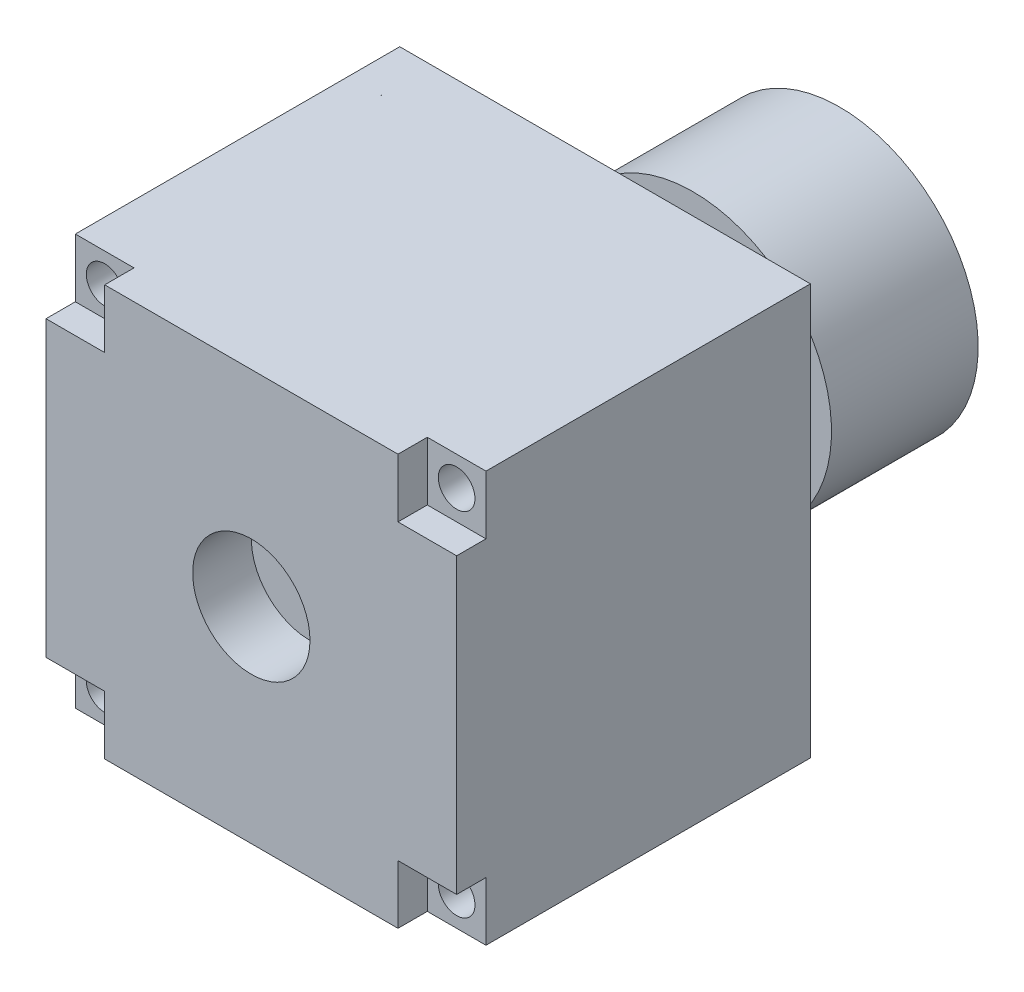
ISO-10303-21;
HEADER;
FILE_DESCRIPTION(('STEP AP214'),'2;1');
FILE_NAME('part.step','',(''),(''),'','','');
FILE_SCHEMA(('AUTOMOTIVE_DESIGN { 1 0 10303 214 1 1 1 1 }'));
ENDSEC;
DATA;
#1=APPLICATION_CONTEXT('core data for automotive mechanical design processes');
#2=APPLICATION_PROTOCOL_DEFINITION('international standard','automotive_design',2000,#1);
#3=PRODUCT_CONTEXT('',#1,'mechanical');
#4=PRODUCT('Part','Part','',(#3));
#5=PRODUCT_RELATED_PRODUCT_CATEGORY('part','',(#4));
#6=PRODUCT_DEFINITION_FORMATION('','',#4);
#7=PRODUCT_DEFINITION_CONTEXT('part definition',#1,'design');
#8=PRODUCT_DEFINITION('design','',#6,#7);
#9=PRODUCT_DEFINITION_SHAPE('','',#8);
#10=(LENGTH_UNIT() NAMED_UNIT(*) SI_UNIT(.MILLI.,.METRE.));
#11=(NAMED_UNIT(*) PLANE_ANGLE_UNIT() SI_UNIT($,.RADIAN.));
#12=(NAMED_UNIT(*) SI_UNIT($,.STERADIAN.) SOLID_ANGLE_UNIT());
#13=UNCERTAINTY_MEASURE_WITH_UNIT(LENGTH_MEASURE(1.E-05),#10,'distance_accuracy_value','');
#14=(GEOMETRIC_REPRESENTATION_CONTEXT(3) GLOBAL_UNCERTAINTY_ASSIGNED_CONTEXT((#13)) GLOBAL_UNIT_ASSIGNED_CONTEXT((#10,
#11,#12)) REPRESENTATION_CONTEXT('',''));
#15=CARTESIAN_POINT('',(0.,0.,0.));
#16=DIRECTION('',(0.,0.,1.));
#17=DIRECTION('',(1.,0.,0.));
#18=AXIS2_PLACEMENT_3D('',#15,#16,#17);
#19=CARTESIAN_POINT('',(0.,0.,-16.));
#20=DIRECTION('',(0.,0.,-1.));
#21=DIRECTION('',(-1.,0.,0.));
#22=AXIS2_PLACEMENT_3D('',#19,#20,#21);
#23=PLANE('',#22);
#24=CARTESIAN_POINT('',(0.,0.,-16.));
#25=DIRECTION('',(0.,0.,-1.));
#26=DIRECTION('',(-1.,0.,0.));
#27=AXIS2_PLACEMENT_3D('',#24,#25,#26);
#28=CIRCLE('',#27,9.44);
#29=CARTESIAN_POINT('',(-9.44,0.,-16.));
#30=VERTEX_POINT('',#29);
#31=EDGE_CURVE('E11',#30,#30,#28,.T.);
#32=ORIENTED_EDGE('',*,*,#31,.T.);
#33=EDGE_LOOP('',(#32));
#34=FACE_BOUND('',#33,.T.);
#35=CARTESIAN_POINT('',(0.,0.,-16.));
#36=DIRECTION('',(0.,0.,-1.));
#37=DIRECTION('',(-1.,0.,0.));
#38=AXIS2_PLACEMENT_3D('',#35,#36,#37);
#39=CIRCLE('',#38,4.);
#40=CARTESIAN_POINT('',(-4.,0.,-16.));
#41=VERTEX_POINT('',#40);
#42=EDGE_CURVE('E55',#41,#41,#39,.T.);
#43=ORIENTED_EDGE('',*,*,#42,.F.);
#44=EDGE_LOOP('',(#43));
#45=FACE_BOUND('',#44,.T.);
#46=ADVANCED_FACE('F44',(#34,#45),#23,.T.);
#47=CARTESIAN_POINT('',(0.,0.,-6.));
#48=DIRECTION('',(0.,0.,-1.));
#49=DIRECTION('',(-1.,0.,0.));
#50=AXIS2_PLACEMENT_3D('',#47,#48,#49);
#51=PLANE('',#50);
#52=CARTESIAN_POINT('',(0.,0.,-6.));
#53=DIRECTION('',(0.,0.,-1.));
#54=DIRECTION('',(-1.,0.,0.));
#55=AXIS2_PLACEMENT_3D('',#52,#53,#54);
#56=CIRCLE('',#55,9.44);
#57=CARTESIAN_POINT('',(-9.44,0.,-6.));
#58=VERTEX_POINT('',#57);
#59=EDGE_CURVE('E48',#58,#58,#56,.T.);
#60=ORIENTED_EDGE('',*,*,#59,.F.);
#61=EDGE_LOOP('',(#60));
#62=FACE_BOUND('',#61,.T.);
#63=CARTESIAN_POINT('',(0.,0.,-6.));
#64=DIRECTION('',(0.,0.,-1.));
#65=DIRECTION('',(-1.,0.,0.));
#66=AXIS2_PLACEMENT_3D('',#63,#64,#65);
#67=CIRCLE('',#66,4.);
#68=CARTESIAN_POINT('',(-4.,0.,-6.));
#69=VERTEX_POINT('',#68);
#70=EDGE_CURVE('E57',#69,#69,#67,.T.);
#71=ORIENTED_EDGE('',*,*,#70,.T.);
#72=EDGE_LOOP('',(#71));
#73=FACE_BOUND('',#72,.T.);
#74=ADVANCED_FACE('F67',(#62,#73),#51,.F.);
#75=CARTESIAN_POINT('',(0.,0.,-16.));
#76=DIRECTION('',(0.,0.,1.));
#77=DIRECTION('',(1.,0.,0.));
#78=AXIS2_PLACEMENT_3D('',#75,#76,#77);
#79=CYLINDRICAL_SURFACE('',#78,9.44);
#80=ORIENTED_EDGE('',*,*,#31,.F.);
#81=EDGE_LOOP('',(#80));
#82=FACE_BOUND('',#81,.T.);
#83=ORIENTED_EDGE('',*,*,#59,.T.);
#84=EDGE_LOOP('',(#83));
#85=FACE_BOUND('',#84,.T.);
#86=ADVANCED_FACE('F46',(#82,#85),#79,.T.);
#87=CARTESIAN_POINT('',(0.,0.,-16.));
#88=DIRECTION('',(0.,0.,1.));
#89=DIRECTION('',(1.,0.,0.));
#90=AXIS2_PLACEMENT_3D('',#87,#88,#89);
#91=CYLINDRICAL_SURFACE('',#90,4.);
#92=ORIENTED_EDGE('',*,*,#42,.T.);
#93=EDGE_LOOP('',(#92));
#94=FACE_BOUND('',#93,.T.);
#95=ORIENTED_EDGE('',*,*,#70,.F.);
#96=EDGE_LOOP('',(#95));
#97=FACE_BOUND('',#96,.T.);
#98=ADVANCED_FACE('F63',(#94,#97),#91,.F.);
#99=CLOSED_SHELL('',(#46,#74,#86,#98));
#100=MANIFOLD_SOLID_BREP('B2',#99);
#101=CARTESIAN_POINT('',(0.,0.,22.12));
#102=DIRECTION('',(0.,0.,-1.));
#103=DIRECTION('',(0.,1.,0.));
#104=AXIS2_PLACEMENT_3D('',#101,#102,#103);
#105=PLANE('',#104);
#106=DIRECTION('',(-1.,0.,0.));
#107=VECTOR('',#106,1.);
#108=CARTESIAN_POINT('',(-14.0000000000001,13.9999999999999,22.12));
#109=LINE('',#108,#107);
#110=CARTESIAN_POINT('',(-10.0000000000001,13.9999999999999,22.12));
#111=VERTEX_POINT('',#110);
#112=CARTESIAN_POINT('',(-14.0000000000001,13.9999999999999,22.12));
#113=VERTEX_POINT('',#112);
#114=EDGE_CURVE('E348',#111,#113,#109,.T.);
#115=ORIENTED_EDGE('',*,*,#114,.T.);
#116=DIRECTION('',(0.,-1.,0.));
#117=VECTOR('',#116,1.);
#118=CARTESIAN_POINT('',(-14.0000000000001,13.9999999999999,22.12));
#119=LINE('',#118,#117);
#120=CARTESIAN_POINT('',(-14.0000000000001,9.99999999999985,22.12));
#121=VERTEX_POINT('',#120);
#122=EDGE_CURVE('E281',#113,#121,#119,.T.);
#123=ORIENTED_EDGE('',*,*,#122,.T.);
#124=DIRECTION('',(1.,0.,0.));
#125=VECTOR('',#124,1.);
#126=CARTESIAN_POINT('',(-14.0000000000001,9.99999999999985,22.12));
#127=LINE('',#126,#125);
#128=CARTESIAN_POINT('',(-10.0000000000001,9.9999999999999,22.12));
#129=VERTEX_POINT('',#128);
#130=EDGE_CURVE('E352',#121,#129,#127,.T.);
#131=ORIENTED_EDGE('',*,*,#130,.T.);
#132=DIRECTION('',(0.,1.,0.));
#133=VECTOR('',#132,1.);
#134=CARTESIAN_POINT('',(-10.0000000000001,13.9999999999999,22.12));
#135=LINE('',#134,#133);
#136=EDGE_CURVE('E355',#129,#111,#135,.T.);
#137=ORIENTED_EDGE('',*,*,#136,.T.);
#138=EDGE_LOOP('',(#115,#123,#131,#137));
#139=FACE_BOUND('',#138,.T.);
#140=CARTESIAN_POINT('',(-12.0000000000001,11.9999999999999,22.12));
#141=DIRECTION('',(0.,0.,1.));
#142=DIRECTION('',(1.,0.,0.));
#143=AXIS2_PLACEMENT_3D('',#140,#141,#142);
#144=CIRCLE('',#143,1.24999999999999);
#145=CARTESIAN_POINT('',(-10.7500000000001,11.9999999999999,22.12));
#146=VERTEX_POINT('',#145);
#147=EDGE_CURVE('E578',#146,#146,#144,.T.);
#148=ORIENTED_EDGE('',*,*,#147,.F.);
#149=EDGE_LOOP('',(#148));
#150=FACE_BOUND('',#149,.T.);
#151=ADVANCED_FACE('F107',(#139,#150),#105,.F.);
#152=CARTESIAN_POINT('',(0.,0.,22.12));
#153=DIRECTION('',(0.,0.,-1.));
#154=DIRECTION('',(1.,0.,0.));
#155=AXIS2_PLACEMENT_3D('',#152,#153,#154);
#156=PLANE('',#155);
#157=DIRECTION('',(0.,1.,0.));
#158=VECTOR('',#157,1.);
#159=CARTESIAN_POINT('',(14.,14.,22.12));
#160=LINE('',#159,#158);
#161=CARTESIAN_POINT('',(14.,10.,22.12));
#162=VERTEX_POINT('',#161);
#163=CARTESIAN_POINT('',(14.,14.,22.12));
#164=VERTEX_POINT('',#163);
#165=EDGE_CURVE('E222',#162,#164,#160,.T.);
#166=ORIENTED_EDGE('',*,*,#165,.T.);
#167=DIRECTION('',(-1.,0.,0.));
#168=VECTOR('',#167,1.);
#169=CARTESIAN_POINT('',(14.,14.,22.12));
#170=LINE('',#169,#168);
#171=CARTESIAN_POINT('',(10.,14.,22.12));
#172=VERTEX_POINT('',#171);
#173=EDGE_CURVE('E227',#164,#172,#170,.T.);
#174=ORIENTED_EDGE('',*,*,#173,.T.);
#175=DIRECTION('',(0.,-1.,0.));
#176=VECTOR('',#175,1.);
#177=CARTESIAN_POINT('',(10.,14.,22.12));
#178=LINE('',#177,#176);
#179=CARTESIAN_POINT('',(10.,10.,22.12));
#180=VERTEX_POINT('',#179);
#181=EDGE_CURVE('E241',#172,#180,#178,.T.);
#182=ORIENTED_EDGE('',*,*,#181,.T.);
#183=DIRECTION('',(1.,0.,0.));
#184=VECTOR('',#183,1.);
#185=CARTESIAN_POINT('',(14.,10.,22.12));
#186=LINE('',#185,#184);
#187=EDGE_CURVE('E229',#180,#162,#186,.T.);
#188=ORIENTED_EDGE('',*,*,#187,.T.);
#189=EDGE_LOOP('',(#166,#174,#182,#188));
#190=FACE_BOUND('',#189,.T.);
#191=CARTESIAN_POINT('',(12.,12.,22.12));
#192=DIRECTION('',(0.,0.,1.));
#193=DIRECTION('',(1.,0.,0.));
#194=AXIS2_PLACEMENT_3D('',#191,#192,#193);
#195=CIRCLE('',#194,1.24999999999999);
#196=CARTESIAN_POINT('',(13.25,12.,22.12));
#197=VERTEX_POINT('',#196);
#198=EDGE_CURVE('E572',#197,#197,#195,.T.);
#199=ORIENTED_EDGE('',*,*,#198,.F.);
#200=EDGE_LOOP('',(#199));
#201=FACE_BOUND('',#200,.T.);
#202=ADVANCED_FACE('F224',(#190,#201),#156,.F.);
#203=CARTESIAN_POINT('',(0.,0.,22.12));
#204=DIRECTION('',(0.,0.,-1.));
#205=DIRECTION('',(-1.,0.,0.));
#206=AXIS2_PLACEMENT_3D('',#203,#204,#205);
#207=PLANE('',#206);
#208=DIRECTION('',(0.,-1.,0.));
#209=VECTOR('',#208,1.);
#210=CARTESIAN_POINT('',(-14.,-14.,22.12));
#211=LINE('',#210,#209);
#212=CARTESIAN_POINT('',(-14.,-10.,22.12));
#213=VERTEX_POINT('',#212);
#214=CARTESIAN_POINT('',(-14.,-14.,22.12));
#215=VERTEX_POINT('',#214);
#216=EDGE_CURVE('E292',#213,#215,#211,.T.);
#217=ORIENTED_EDGE('',*,*,#216,.T.);
#218=DIRECTION('',(1.,0.,0.));
#219=VECTOR('',#218,1.);
#220=CARTESIAN_POINT('',(-14.,-14.,22.12));
#221=LINE('',#220,#219);
#222=CARTESIAN_POINT('',(-10.,-14.,22.12));
#223=VERTEX_POINT('',#222);
#224=EDGE_CURVE('E289',#215,#223,#221,.T.);
#225=ORIENTED_EDGE('',*,*,#224,.T.);
#226=DIRECTION('',(0.,1.,0.));
#227=VECTOR('',#226,1.);
#228=CARTESIAN_POINT('',(-10.,-14.,22.12));
#229=LINE('',#228,#227);
#230=CARTESIAN_POINT('',(-10.,-10.,22.12));
#231=VERTEX_POINT('',#230);
#232=EDGE_CURVE('E297',#223,#231,#229,.T.);
#233=ORIENTED_EDGE('',*,*,#232,.T.);
#234=DIRECTION('',(-1.,0.,0.));
#235=VECTOR('',#234,1.);
#236=CARTESIAN_POINT('',(-14.,-10.,22.12));
#237=LINE('',#236,#235);
#238=EDGE_CURVE('E306',#231,#213,#237,.T.);
#239=ORIENTED_EDGE('',*,*,#238,.T.);
#240=EDGE_LOOP('',(#217,#225,#233,#239));
#241=FACE_BOUND('',#240,.T.);
#242=CARTESIAN_POINT('',(-12.,-12.,22.12));
#243=DIRECTION('',(0.,0.,1.));
#244=DIRECTION('',(1.,0.,0.));
#245=AXIS2_PLACEMENT_3D('',#242,#243,#244);
#246=CIRCLE('',#245,1.24999999999999);
#247=CARTESIAN_POINT('',(-10.75,-12.,22.12));
#248=VERTEX_POINT('',#247);
#249=EDGE_CURVE('E336',#248,#248,#246,.T.);
#250=ORIENTED_EDGE('',*,*,#249,.F.);
#251=EDGE_LOOP('',(#250));
#252=FACE_BOUND('',#251,.T.);
#253=ADVANCED_FACE('F398',(#241,#252),#207,.F.);
#254=CARTESIAN_POINT('',(14.,-14.,24.12));
#255=DIRECTION('',(-1.,0.,0.));
#256=DIRECTION('',(0.,0.,1.));
#257=AXIS2_PLACEMENT_3D('',#254,#255,#256);
#258=PLANE('',#257);
#259=DIRECTION('',(0.,1.,0.));
#260=VECTOR('',#259,1.);
#261=CARTESIAN_POINT('',(14.,-14.,24.12));
#262=LINE('',#261,#260);
#263=CARTESIAN_POINT('',(14.,-9.99999999999995,24.12));
#264=VERTEX_POINT('',#263);
#265=CARTESIAN_POINT('',(14.,10.,24.12));
#266=VERTEX_POINT('',#265);
#267=EDGE_CURVE('E269',#264,#266,#262,.T.);
#268=ORIENTED_EDGE('',*,*,#267,.F.);
#269=DIRECTION('',(0.,0.,1.));
#270=VECTOR('',#269,1.);
#271=CARTESIAN_POINT('',(14.,-9.99999999999995,22.12));
#272=LINE('',#271,#270);
#273=CARTESIAN_POINT('',(14.,-9.99999999999995,22.12));
#274=VERTEX_POINT('',#273);
#275=EDGE_CURVE('E130',#274,#264,#272,.T.);
#276=ORIENTED_EDGE('',*,*,#275,.F.);
#277=DIRECTION('',(0.,1.,0.));
#278=VECTOR('',#277,1.);
#279=CARTESIAN_POINT('',(14.,-14.,22.12));
#280=LINE('',#279,#278);
#281=CARTESIAN_POINT('',(14.,-14.,22.12));
#282=VERTEX_POINT('',#281);
#283=EDGE_CURVE('E546',#282,#274,#280,.T.);
#284=ORIENTED_EDGE('',*,*,#283,.F.);
#285=DIRECTION('',(0.,0.,-1.));
#286=VECTOR('',#285,1.);
#287=CARTESIAN_POINT('',(14.,-14.,24.12));
#288=LINE('',#287,#286);
#289=CARTESIAN_POINT('',(14.,-14.,0.));
#290=VERTEX_POINT('',#289);
#291=EDGE_CURVE('E249',#282,#290,#288,.T.);
#292=ORIENTED_EDGE('',*,*,#291,.T.);
#293=DIRECTION('',(0.,1.,0.));
#294=VECTOR('',#293,1.);
#295=CARTESIAN_POINT('',(14.,-14.,0.));
#296=LINE('',#295,#294);
#297=CARTESIAN_POINT('',(14.,14.,0.));
#298=VERTEX_POINT('',#297);
#299=EDGE_CURVE('E246',#290,#298,#296,.T.);
#300=ORIENTED_EDGE('',*,*,#299,.T.);
#301=DIRECTION('',(0.,0.,-1.));
#302=VECTOR('',#301,1.);
#303=CARTESIAN_POINT('',(14.,14.,24.12));
#304=LINE('',#303,#302);
#305=EDGE_CURVE('E42',#164,#298,#304,.T.);
#306=ORIENTED_EDGE('',*,*,#305,.F.);
#307=ORIENTED_EDGE('',*,*,#165,.F.);
#308=DIRECTION('',(0.,0.,1.));
#309=VECTOR('',#308,1.);
#310=CARTESIAN_POINT('',(14.,10.,22.12));
#311=LINE('',#310,#309);
#312=EDGE_CURVE('E548',#162,#266,#311,.T.);
#313=ORIENTED_EDGE('',*,*,#312,.T.);
#314=EDGE_LOOP('',(#268,#276,#284,#292,#300,#306,#307,#313));
#315=FACE_BOUND('',#314,.T.);
#316=ADVANCED_FACE('F109',(#315),#258,.F.);
#317=CARTESIAN_POINT('',(-14.,14.,24.12));
#318=DIRECTION('',(0.,-1.,0.));
#319=DIRECTION('',(0.,0.,-1.));
#320=AXIS2_PLACEMENT_3D('',#317,#318,#319);
#321=PLANE('',#320);
#322=ORIENTED_EDGE('',*,*,#114,.F.);
#323=DIRECTION('',(0.,0.,1.));
#324=VECTOR('',#323,1.);
#325=CARTESIAN_POINT('',(-10.0000000000001,13.9999999999999,22.12));
#326=LINE('',#325,#324);
#327=CARTESIAN_POINT('',(-10.0000000000001,13.9999999999999,24.12));
#328=VERTEX_POINT('',#327);
#329=EDGE_CURVE('E364',#111,#328,#326,.T.);
#330=ORIENTED_EDGE('',*,*,#329,.T.);
#331=DIRECTION('',(-1.,0.,0.));
#332=VECTOR('',#331,1.);
#333=CARTESIAN_POINT('',(-14.,14.,24.12));
#334=LINE('',#333,#332);
#335=CARTESIAN_POINT('',(10.,14.,24.12));
#336=VERTEX_POINT('',#335);
#337=EDGE_CURVE('E318',#336,#328,#334,.T.);
#338=ORIENTED_EDGE('',*,*,#337,.F.);
#339=DIRECTION('',(0.,0.,1.));
#340=VECTOR('',#339,1.);
#341=CARTESIAN_POINT('',(10.,14.,22.12));
#342=LINE('',#341,#340);
#343=EDGE_CURVE('E122',#172,#336,#342,.T.);
#344=ORIENTED_EDGE('',*,*,#343,.F.);
#345=ORIENTED_EDGE('',*,*,#173,.F.);
#346=ORIENTED_EDGE('',*,*,#305,.T.);
#347=DIRECTION('',(-1.,0.,0.));
#348=VECTOR('',#347,1.);
#349=CARTESIAN_POINT('',(-14.,14.,0.));
#350=LINE('',#349,#348);
#351=CARTESIAN_POINT('',(-14.,14.,0.));
#352=VERTEX_POINT('',#351);
#353=EDGE_CURVE('E253',#298,#352,#350,.T.);
#354=ORIENTED_EDGE('',*,*,#353,.T.);
#355=DIRECTION('',(0.,0.,-1.));
#356=VECTOR('',#355,1.);
#357=CARTESIAN_POINT('',(-14.,14.,24.12));
#358=LINE('',#357,#356);
#359=EDGE_CURVE('E115',#113,#352,#358,.T.);
#360=ORIENTED_EDGE('',*,*,#359,.F.);
#361=EDGE_LOOP('',(#322,#330,#338,#344,#345,#346,#354,#360));
#362=FACE_BOUND('',#361,.T.);
#363=ADVANCED_FACE('F237',(#362),#321,.F.);
#364=CARTESIAN_POINT('',(-14.,-14.,24.12));
#365=DIRECTION('',(1.,0.,0.));
#366=DIRECTION('',(0.,0.,-1.));
#367=AXIS2_PLACEMENT_3D('',#364,#365,#366);
#368=PLANE('',#367);
#369=DIRECTION('',(0.,-1.,0.));
#370=VECTOR('',#369,1.);
#371=CARTESIAN_POINT('',(-14.,-14.,24.12));
#372=LINE('',#371,#370);
#373=CARTESIAN_POINT('',(-14.,9.99999999999985,24.12));
#374=VERTEX_POINT('',#373);
#375=CARTESIAN_POINT('',(-14.,-10.,24.12));
#376=VERTEX_POINT('',#375);
#377=EDGE_CURVE('E320',#374,#376,#372,.T.);
#378=ORIENTED_EDGE('',*,*,#377,.F.);
#379=DIRECTION('',(0.,0.,1.));
#380=VECTOR('',#379,1.);
#381=CARTESIAN_POINT('',(-14.0000000000001,9.99999999999985,22.12));
#382=LINE('',#381,#380);
#383=EDGE_CURVE('E358',#121,#374,#382,.T.);
#384=ORIENTED_EDGE('',*,*,#383,.F.);
#385=ORIENTED_EDGE('',*,*,#122,.F.);
#386=ORIENTED_EDGE('',*,*,#359,.T.);
#387=DIRECTION('',(0.,-1.,0.));
#388=VECTOR('',#387,1.);
#389=CARTESIAN_POINT('',(-14.,-14.,0.));
#390=LINE('',#389,#388);
#391=CARTESIAN_POINT('',(-14.,-14.,0.));
#392=VERTEX_POINT('',#391);
#393=EDGE_CURVE('E256',#352,#392,#390,.T.);
#394=ORIENTED_EDGE('',*,*,#393,.T.);
#395=DIRECTION('',(0.,0.,-1.));
#396=VECTOR('',#395,1.);
#397=CARTESIAN_POINT('',(-14.,-14.,24.12));
#398=LINE('',#397,#396);
#399=EDGE_CURVE('E271',#215,#392,#398,.T.);
#400=ORIENTED_EDGE('',*,*,#399,.F.);
#401=ORIENTED_EDGE('',*,*,#216,.F.);
#402=DIRECTION('',(0.,0.,1.));
#403=VECTOR('',#402,1.);
#404=CARTESIAN_POINT('',(-14.,-10.,22.12));
#405=LINE('',#404,#403);
#406=EDGE_CURVE('E259',#213,#376,#405,.T.);
#407=ORIENTED_EDGE('',*,*,#406,.T.);
#408=EDGE_LOOP('',(#378,#384,#385,#386,#394,#400,#401,#407));
#409=FACE_BOUND('',#408,.T.);
#410=ADVANCED_FACE('F276',(#409),#368,.F.);
#411=CARTESIAN_POINT('',(-14.,-14.,24.12));
#412=DIRECTION('',(0.,1.,0.));
#413=DIRECTION('',(0.,0.,1.));
#414=AXIS2_PLACEMENT_3D('',#411,#412,#413);
#415=PLANE('',#414);
#416=DIRECTION('',(1.,0.,0.));
#417=VECTOR('',#416,1.);
#418=CARTESIAN_POINT('',(14.,-14.,22.12));
#419=LINE('',#418,#417);
#420=CARTESIAN_POINT('',(10.,-14.,22.12));
#421=VERTEX_POINT('',#420);
#422=EDGE_CURVE('E332',#421,#282,#419,.T.);
#423=ORIENTED_EDGE('',*,*,#422,.F.);
#424=DIRECTION('',(0.,0.,1.));
#425=VECTOR('',#424,1.);
#426=CARTESIAN_POINT('',(10.,-14.,22.12));
#427=LINE('',#426,#425);
#428=CARTESIAN_POINT('',(10.,-14.,24.12));
#429=VERTEX_POINT('',#428);
#430=EDGE_CURVE('E331',#421,#429,#427,.T.);
#431=ORIENTED_EDGE('',*,*,#430,.T.);
#432=DIRECTION('',(1.,0.,0.));
#433=VECTOR('',#432,1.);
#434=CARTESIAN_POINT('',(-14.,-14.,24.12));
#435=LINE('',#434,#433);
#436=CARTESIAN_POINT('',(-10.,-14.,24.12));
#437=VERTEX_POINT('',#436);
#438=EDGE_CURVE('E262',#437,#429,#435,.T.);
#439=ORIENTED_EDGE('',*,*,#438,.F.);
#440=DIRECTION('',(0.,0.,1.));
#441=VECTOR('',#440,1.);
#442=CARTESIAN_POINT('',(-10.,-14.,22.12));
#443=LINE('',#442,#441);
#444=EDGE_CURVE('E308',#223,#437,#443,.T.);
#445=ORIENTED_EDGE('',*,*,#444,.F.);
#446=ORIENTED_EDGE('',*,*,#224,.F.);
#447=ORIENTED_EDGE('',*,*,#399,.T.);
#448=DIRECTION('',(1.,0.,0.));
#449=VECTOR('',#448,1.);
#450=CARTESIAN_POINT('',(-14.,-14.,0.));
#451=LINE('',#450,#449);
#452=EDGE_CURVE('E267',#392,#290,#451,.T.);
#453=ORIENTED_EDGE('',*,*,#452,.T.);
#454=ORIENTED_EDGE('',*,*,#291,.F.);
#455=EDGE_LOOP('',(#423,#431,#439,#445,#446,#447,#453,#454));
#456=FACE_BOUND('',#455,.T.);
#457=ADVANCED_FACE('F285',(#456),#415,.F.);
#458=CARTESIAN_POINT('',(0.,0.,24.12));
#459=DIRECTION('',(0.,0.,-1.));
#460=DIRECTION('',(-1.,0.,0.));
#461=AXIS2_PLACEMENT_3D('',#458,#459,#460);
#462=PLANE('',#461);
#463=CARTESIAN_POINT('',(0.,0.,24.12));
#464=DIRECTION('',(0.,0.,1.));
#465=DIRECTION('',(1.,0.,0.));
#466=AXIS2_PLACEMENT_3D('',#463,#464,#465);
#467=CIRCLE('',#466,4.);
#468=CARTESIAN_POINT('',(4.,0.,24.12));
#469=VERTEX_POINT('',#468);
#470=EDGE_CURVE('E254',#469,#469,#467,.T.);
#471=ORIENTED_EDGE('',*,*,#470,.F.);
#472=EDGE_LOOP('',(#471));
#473=FACE_BOUND('',#472,.T.);
#474=ORIENTED_EDGE('',*,*,#337,.T.);
#475=DIRECTION('',(0.,1.,0.));
#476=VECTOR('',#475,1.);
#477=CARTESIAN_POINT('',(-10.0000000000001,13.9999999999999,24.12));
#478=LINE('',#477,#476);
#479=CARTESIAN_POINT('',(-10.0000000000001,9.9999999999999,24.12));
#480=VERTEX_POINT('',#479);
#481=EDGE_CURVE('E350',#480,#328,#478,.T.);
#482=ORIENTED_EDGE('',*,*,#481,.F.);
#483=DIRECTION('',(1.,0.,0.));
#484=VECTOR('',#483,1.);
#485=CARTESIAN_POINT('',(-14.0000000000001,9.99999999999985,24.12));
#486=LINE('',#485,#484);
#487=EDGE_CURVE('E359',#374,#480,#486,.T.);
#488=ORIENTED_EDGE('',*,*,#487,.F.);
#489=ORIENTED_EDGE('',*,*,#377,.T.);
#490=DIRECTION('',(-1.,0.,0.));
#491=VECTOR('',#490,1.);
#492=CARTESIAN_POINT('',(-14.,-10.,24.12));
#493=LINE('',#492,#491);
#494=CARTESIAN_POINT('',(-10.,-10.,24.12));
#495=VERTEX_POINT('',#494);
#496=EDGE_CURVE('E295',#495,#376,#493,.T.);
#497=ORIENTED_EDGE('',*,*,#496,.F.);
#498=DIRECTION('',(0.,1.,0.));
#499=VECTOR('',#498,1.);
#500=CARTESIAN_POINT('',(-10.,-14.,24.12));
#501=LINE('',#500,#499);
#502=EDGE_CURVE('E300',#437,#495,#501,.T.);
#503=ORIENTED_EDGE('',*,*,#502,.F.);
#504=ORIENTED_EDGE('',*,*,#438,.T.);
#505=DIRECTION('',(0.,-1.,0.));
#506=VECTOR('',#505,1.);
#507=CARTESIAN_POINT('',(10.,-14.,24.12));
#508=LINE('',#507,#506);
#509=CARTESIAN_POINT('',(10.,-9.99999999999997,24.12));
#510=VERTEX_POINT('',#509);
#511=EDGE_CURVE('E329',#510,#429,#508,.T.);
#512=ORIENTED_EDGE('',*,*,#511,.F.);
#513=DIRECTION('',(-1.,0.,0.));
#514=VECTOR('',#513,1.);
#515=CARTESIAN_POINT('',(14.,-9.99999999999995,24.12));
#516=LINE('',#515,#514);
#517=EDGE_CURVE('E545',#264,#510,#516,.T.);
#518=ORIENTED_EDGE('',*,*,#517,.F.);
#519=ORIENTED_EDGE('',*,*,#267,.T.);
#520=DIRECTION('',(1.,0.,0.));
#521=VECTOR('',#520,1.);
#522=CARTESIAN_POINT('',(14.,10.,24.12));
#523=LINE('',#522,#521);
#524=CARTESIAN_POINT('',(10.,10.,24.12));
#525=VERTEX_POINT('',#524);
#526=EDGE_CURVE('E233',#525,#266,#523,.T.);
#527=ORIENTED_EDGE('',*,*,#526,.F.);
#528=DIRECTION('',(0.,-1.,0.));
#529=VECTOR('',#528,1.);
#530=CARTESIAN_POINT('',(10.,14.,24.12));
#531=LINE('',#530,#529);
#532=EDGE_CURVE('E367',#336,#525,#531,.T.);
#533=ORIENTED_EDGE('',*,*,#532,.F.);
#534=EDGE_LOOP('',(#474,#482,#488,#489,#497,#503,#504,#512,#518,#519,#527,#533));
#535=FACE_BOUND('',#534,.T.);
#536=ADVANCED_FACE('F328',(#473,#535),#462,.F.);
#537=CARTESIAN_POINT('',(0.,0.,0.));
#538=DIRECTION('',(0.,0.,-1.));
#539=DIRECTION('',(-1.,0.,0.));
#540=AXIS2_PLACEMENT_3D('',#537,#538,#539);
#541=PLANE('',#540);
#542=CARTESIAN_POINT('',(0.,0.,0.));
#543=DIRECTION('',(0.,0.,-1.));
#544=DIRECTION('',(-1.,0.,0.));
#545=AXIS2_PLACEMENT_3D('',#542,#543,#544);
#546=CIRCLE('',#545,2.);
#547=CARTESIAN_POINT('',(-2.,0.,0.));
#548=VERTEX_POINT('',#547);
#549=EDGE_CURVE('E582',#548,#548,#546,.T.);
#550=ORIENTED_EDGE('',*,*,#549,.F.);
#551=EDGE_LOOP('',(#550));
#552=FACE_BOUND('',#551,.T.);
#553=CARTESIAN_POINT('',(-12.0000000000001,11.9999999999999,0.));
#554=DIRECTION('',(0.,0.,-1.));
#555=DIRECTION('',(-1.,0.,0.));
#556=AXIS2_PLACEMENT_3D('',#553,#554,#555);
#557=CIRCLE('',#556,1.24999999999999);
#558=CARTESIAN_POINT('',(-13.2500000000001,11.9999999999999,0.));
#559=VERTEX_POINT('',#558);
#560=EDGE_CURVE('E575',#559,#559,#557,.T.);
#561=ORIENTED_EDGE('',*,*,#560,.F.);
#562=EDGE_LOOP('',(#561));
#563=FACE_BOUND('',#562,.T.);
#564=CARTESIAN_POINT('',(12.,12.,0.));
#565=DIRECTION('',(0.,0.,-1.));
#566=DIRECTION('',(-1.,0.,0.));
#567=AXIS2_PLACEMENT_3D('',#564,#565,#566);
#568=CIRCLE('',#567,1.24999999999999);
#569=CARTESIAN_POINT('',(10.75,12.,0.));
#570=VERTEX_POINT('',#569);
#571=EDGE_CURVE('E569',#570,#570,#568,.T.);
#572=ORIENTED_EDGE('',*,*,#571,.F.);
#573=EDGE_LOOP('',(#572));
#574=FACE_BOUND('',#573,.T.);
#575=CARTESIAN_POINT('',(12.,-12.,0.));
#576=DIRECTION('',(0.,0.,-1.));
#577=DIRECTION('',(-1.,0.,0.));
#578=AXIS2_PLACEMENT_3D('',#575,#576,#577);
#579=CIRCLE('',#578,1.24999999999999);
#580=CARTESIAN_POINT('',(10.7500000000001,-12.,0.));
#581=VERTEX_POINT('',#580);
#582=EDGE_CURVE('E362',#581,#581,#579,.T.);
#583=ORIENTED_EDGE('',*,*,#582,.F.);
#584=EDGE_LOOP('',(#583));
#585=FACE_BOUND('',#584,.T.);
#586=CARTESIAN_POINT('',(-12.,-12.,0.));
#587=DIRECTION('',(0.,0.,-1.));
#588=DIRECTION('',(-1.,0.,0.));
#589=AXIS2_PLACEMENT_3D('',#586,#587,#588);
#590=CIRCLE('',#589,1.24999999999999);
#591=CARTESIAN_POINT('',(-13.25,-12.,0.));
#592=VERTEX_POINT('',#591);
#593=EDGE_CURVE('E340',#592,#592,#590,.T.);
#594=ORIENTED_EDGE('',*,*,#593,.F.);
#595=EDGE_LOOP('',(#594));
#596=FACE_BOUND('',#595,.T.);
#597=ORIENTED_EDGE('',*,*,#299,.F.);
#598=ORIENTED_EDGE('',*,*,#452,.F.);
#599=ORIENTED_EDGE('',*,*,#393,.F.);
#600=ORIENTED_EDGE('',*,*,#353,.F.);
#601=EDGE_LOOP('',(#597,#598,#599,#600));
#602=FACE_BOUND('',#601,.T.);
#603=ADVANCED_FACE('F282',(#552,#563,#574,#585,#596,#602),#541,.T.);
#604=CARTESIAN_POINT('',(-14.,-10.,22.12));
#605=DIRECTION('',(0.,1.,0.));
#606=DIRECTION('',(0.,0.,1.));
#607=AXIS2_PLACEMENT_3D('',#604,#605,#606);
#608=PLANE('',#607);
#609=ORIENTED_EDGE('',*,*,#496,.T.);
#610=ORIENTED_EDGE('',*,*,#406,.F.);
#611=ORIENTED_EDGE('',*,*,#238,.F.);
#612=DIRECTION('',(0.,0.,1.));
#613=VECTOR('',#612,1.);
#614=CARTESIAN_POINT('',(-10.,-10.,22.12));
#615=LINE('',#614,#613);
#616=EDGE_CURVE('E313',#231,#495,#615,.T.);
#617=ORIENTED_EDGE('',*,*,#616,.T.);
#618=EDGE_LOOP('',(#609,#610,#611,#617));
#619=FACE_BOUND('',#618,.T.);
#620=ADVANCED_FACE('F388',(#619),#608,.F.);
#621=CARTESIAN_POINT('',(-10.,-14.,22.12));
#622=DIRECTION('',(1.,0.,0.));
#623=DIRECTION('',(0.,0.,-1.));
#624=AXIS2_PLACEMENT_3D('',#621,#622,#623);
#625=PLANE('',#624);
#626=ORIENTED_EDGE('',*,*,#502,.T.);
#627=ORIENTED_EDGE('',*,*,#616,.F.);
#628=ORIENTED_EDGE('',*,*,#232,.F.);
#629=ORIENTED_EDGE('',*,*,#444,.T.);
#630=EDGE_LOOP('',(#626,#627,#628,#629));
#631=FACE_BOUND('',#630,.T.);
#632=ADVANCED_FACE('F379',(#631),#625,.F.);
#633=CARTESIAN_POINT('',(0.,0.,22.12));
#634=DIRECTION('',(0.,0.,1.));
#635=DIRECTION('',(1.,0.,0.));
#636=AXIS2_PLACEMENT_3D('',#633,#634,#635);
#637=CYLINDRICAL_SURFACE('',#636,4.);
#638=ORIENTED_EDGE('',*,*,#470,.T.);
#639=EDGE_LOOP('',(#638));
#640=FACE_BOUND('',#639,.T.);
#641=CARTESIAN_POINT('',(0.,0.,20.12));
#642=DIRECTION('',(0.,0.,1.));
#643=DIRECTION('',(1.,0.,0.));
#644=AXIS2_PLACEMENT_3D('',#641,#642,#643);
#645=CIRCLE('',#644,4.);
#646=CARTESIAN_POINT('',(4.,0.,20.12));
#647=VERTEX_POINT('',#646);
#648=EDGE_CURVE('E310',#647,#647,#645,.T.);
#649=ORIENTED_EDGE('',*,*,#648,.F.);
#650=EDGE_LOOP('',(#649));
#651=FACE_BOUND('',#650,.T.);
#652=ADVANCED_FACE('F377',(#640,#651),#637,.F.);
#653=CARTESIAN_POINT('',(0.,0.,20.12));
#654=DIRECTION('',(0.,0.,1.));
#655=DIRECTION('',(1.,0.,0.));
#656=AXIS2_PLACEMENT_3D('',#653,#654,#655);
#657=PLANE('',#656);
#658=ORIENTED_EDGE('',*,*,#648,.T.);
#659=EDGE_LOOP('',(#658));
#660=FACE_BOUND('',#659,.T.);
#661=ADVANCED_FACE('F375',(#660),#657,.T.);
#662=CARTESIAN_POINT('',(-12.,-12.,22.12));
#663=DIRECTION('',(0.,0.,1.));
#664=DIRECTION('',(1.,0.,0.));
#665=AXIS2_PLACEMENT_3D('',#662,#663,#664);
#666=CYLINDRICAL_SURFACE('',#665,1.24999999999999);
#667=ORIENTED_EDGE('',*,*,#249,.T.);
#668=EDGE_LOOP('',(#667));
#669=FACE_BOUND('',#668,.T.);
#670=ORIENTED_EDGE('',*,*,#593,.T.);
#671=EDGE_LOOP('',(#670));
#672=FACE_BOUND('',#671,.T.);
#673=ADVANCED_FACE('F386',(#669,#672),#666,.F.);
#674=CARTESIAN_POINT('',(14.,10.,22.12));
#675=DIRECTION('',(0.,-1.,0.));
#676=DIRECTION('',(0.,0.,-1.));
#677=AXIS2_PLACEMENT_3D('',#674,#675,#676);
#678=PLANE('',#677);
#679=ORIENTED_EDGE('',*,*,#526,.T.);
#680=ORIENTED_EDGE('',*,*,#312,.F.);
#681=ORIENTED_EDGE('',*,*,#187,.F.);
#682=DIRECTION('',(0.,0.,1.));
#683=VECTOR('',#682,1.);
#684=CARTESIAN_POINT('',(10.,10.,22.12));
#685=LINE('',#684,#683);
#686=EDGE_CURVE('E549',#180,#525,#685,.T.);
#687=ORIENTED_EDGE('',*,*,#686,.T.);
#688=EDGE_LOOP('',(#679,#680,#681,#687));
#689=FACE_BOUND('',#688,.T.);
#690=ADVANCED_FACE('F416',(#689),#678,.F.);
#691=CARTESIAN_POINT('',(10.,14.,22.12));
#692=DIRECTION('',(-1.,0.,0.));
#693=DIRECTION('',(0.,0.,1.));
#694=AXIS2_PLACEMENT_3D('',#691,#692,#693);
#695=PLANE('',#694);
#696=ORIENTED_EDGE('',*,*,#532,.T.);
#697=ORIENTED_EDGE('',*,*,#686,.F.);
#698=ORIENTED_EDGE('',*,*,#181,.F.);
#699=ORIENTED_EDGE('',*,*,#343,.T.);
#700=EDGE_LOOP('',(#696,#697,#698,#699));
#701=FACE_BOUND('',#700,.T.);
#702=ADVANCED_FACE('F421',(#701),#695,.F.);
#703=CARTESIAN_POINT('',(10.,-14.,22.12));
#704=DIRECTION('',(-1.,0.,0.));
#705=DIRECTION('',(0.,-1.,0.));
#706=AXIS2_PLACEMENT_3D('',#703,#704,#705);
#707=PLANE('',#706);
#708=ORIENTED_EDGE('',*,*,#511,.T.);
#709=ORIENTED_EDGE('',*,*,#430,.F.);
#710=DIRECTION('',(0.,-1.,0.));
#711=VECTOR('',#710,1.);
#712=CARTESIAN_POINT('',(10.,-14.,22.12));
#713=LINE('',#712,#711);
#714=CARTESIAN_POINT('',(10.,-9.99999999999997,22.12));
#715=VERTEX_POINT('',#714);
#716=EDGE_CURVE('E347',#715,#421,#713,.T.);
#717=ORIENTED_EDGE('',*,*,#716,.F.);
#718=DIRECTION('',(0.,0.,1.));
#719=VECTOR('',#718,1.);
#720=CARTESIAN_POINT('',(10.,-9.99999999999997,22.12));
#721=LINE('',#720,#719);
#722=EDGE_CURVE('E337',#715,#510,#721,.T.);
#723=ORIENTED_EDGE('',*,*,#722,.T.);
#724=EDGE_LOOP('',(#708,#709,#717,#723));
#725=FACE_BOUND('',#724,.T.);
#726=ADVANCED_FACE('F541',(#725),#707,.F.);
#727=CARTESIAN_POINT('',(14.,-9.99999999999995,22.12));
#728=DIRECTION('',(0.,1.,0.));
#729=DIRECTION('',(-1.,0.,0.));
#730=AXIS2_PLACEMENT_3D('',#727,#728,#729);
#731=PLANE('',#730);
#732=ORIENTED_EDGE('',*,*,#517,.T.);
#733=ORIENTED_EDGE('',*,*,#722,.F.);
#734=DIRECTION('',(-1.,0.,0.));
#735=VECTOR('',#734,1.);
#736=CARTESIAN_POINT('',(14.,-9.99999999999995,22.12));
#737=LINE('',#736,#735);
#738=EDGE_CURVE('E553',#274,#715,#737,.T.);
#739=ORIENTED_EDGE('',*,*,#738,.F.);
#740=ORIENTED_EDGE('',*,*,#275,.T.);
#741=EDGE_LOOP('',(#732,#733,#739,#740));
#742=FACE_BOUND('',#741,.T.);
#743=ADVANCED_FACE('F403',(#742),#731,.F.);
#744=CARTESIAN_POINT('',(0.,0.,22.12));
#745=DIRECTION('',(0.,0.,-1.));
#746=DIRECTION('',(0.,-1.,0.));
#747=AXIS2_PLACEMENT_3D('',#744,#745,#746);
#748=PLANE('',#747);
#749=CARTESIAN_POINT('',(12.,-12.,22.12));
#750=DIRECTION('',(0.,0.,1.));
#751=DIRECTION('',(1.,0.,0.));
#752=AXIS2_PLACEMENT_3D('',#749,#750,#751);
#753=CIRCLE('',#752,1.24999999999999);
#754=CARTESIAN_POINT('',(13.25,-12.,22.12));
#755=VERTEX_POINT('',#754);
#756=EDGE_CURVE('E566',#755,#755,#753,.T.);
#757=ORIENTED_EDGE('',*,*,#756,.F.);
#758=EDGE_LOOP('',(#757));
#759=FACE_BOUND('',#758,.T.);
#760=ORIENTED_EDGE('',*,*,#422,.T.);
#761=ORIENTED_EDGE('',*,*,#283,.T.);
#762=ORIENTED_EDGE('',*,*,#738,.T.);
#763=ORIENTED_EDGE('',*,*,#716,.T.);
#764=EDGE_LOOP('',(#760,#761,#762,#763));
#765=FACE_BOUND('',#764,.T.);
#766=ADVANCED_FACE('F409',(#759,#765),#748,.F.);
#767=CARTESIAN_POINT('',(-10.0000000000001,13.9999999999999,22.12));
#768=DIRECTION('',(1.,0.,0.));
#769=DIRECTION('',(0.,1.,0.));
#770=AXIS2_PLACEMENT_3D('',#767,#768,#769);
#771=PLANE('',#770);
#772=ORIENTED_EDGE('',*,*,#481,.T.);
#773=ORIENTED_EDGE('',*,*,#329,.F.);
#774=ORIENTED_EDGE('',*,*,#136,.F.);
#775=DIRECTION('',(0.,0.,1.));
#776=VECTOR('',#775,1.);
#777=CARTESIAN_POINT('',(-10.0000000000001,9.9999999999999,22.12));
#778=LINE('',#777,#776);
#779=EDGE_CURVE('E368',#129,#480,#778,.T.);
#780=ORIENTED_EDGE('',*,*,#779,.T.);
#781=EDGE_LOOP('',(#772,#773,#774,#780));
#782=FACE_BOUND('',#781,.T.);
#783=ADVANCED_FACE('F405',(#782),#771,.F.);
#784=CARTESIAN_POINT('',(-14.0000000000001,9.99999999999985,22.12));
#785=DIRECTION('',(0.,-1.,0.));
#786=DIRECTION('',(1.,0.,0.));
#787=AXIS2_PLACEMENT_3D('',#784,#785,#786);
#788=PLANE('',#787);
#789=ORIENTED_EDGE('',*,*,#487,.T.);
#790=ORIENTED_EDGE('',*,*,#779,.F.);
#791=ORIENTED_EDGE('',*,*,#130,.F.);
#792=ORIENTED_EDGE('',*,*,#383,.T.);
#793=EDGE_LOOP('',(#789,#790,#791,#792));
#794=FACE_BOUND('',#793,.T.);
#795=ADVANCED_FACE('F408',(#794),#788,.F.);
#796=CARTESIAN_POINT('',(12.,-12.,22.12));
#797=DIRECTION('',(0.,0.,1.));
#798=DIRECTION('',(1.,0.,0.));
#799=AXIS2_PLACEMENT_3D('',#796,#797,#798);
#800=CYLINDRICAL_SURFACE('',#799,1.24999999999999);
#801=ORIENTED_EDGE('',*,*,#756,.T.);
#802=EDGE_LOOP('',(#801));
#803=FACE_BOUND('',#802,.T.);
#804=ORIENTED_EDGE('',*,*,#582,.T.);
#805=EDGE_LOOP('',(#804));
#806=FACE_BOUND('',#805,.T.);
#807=ADVANCED_FACE('F413',(#803,#806),#800,.F.);
#808=CARTESIAN_POINT('',(12.,12.,22.12));
#809=DIRECTION('',(0.,0.,1.));
#810=DIRECTION('',(1.,0.,0.));
#811=AXIS2_PLACEMENT_3D('',#808,#809,#810);
#812=CYLINDRICAL_SURFACE('',#811,1.24999999999999);
#813=ORIENTED_EDGE('',*,*,#198,.T.);
#814=EDGE_LOOP('',(#813));
#815=FACE_BOUND('',#814,.T.);
#816=ORIENTED_EDGE('',*,*,#571,.T.);
#817=EDGE_LOOP('',(#816));
#818=FACE_BOUND('',#817,.T.);
#819=ADVANCED_FACE('F487',(#815,#818),#812,.F.);
#820=CARTESIAN_POINT('',(-12.0000000000001,11.9999999999999,22.12));
#821=DIRECTION('',(0.,0.,1.));
#822=DIRECTION('',(1.,0.,0.));
#823=AXIS2_PLACEMENT_3D('',#820,#821,#822);
#824=CYLINDRICAL_SURFACE('',#823,1.24999999999999);
#825=ORIENTED_EDGE('',*,*,#147,.T.);
#826=EDGE_LOOP('',(#825));
#827=FACE_BOUND('',#826,.T.);
#828=ORIENTED_EDGE('',*,*,#560,.T.);
#829=EDGE_LOOP('',(#828));
#830=FACE_BOUND('',#829,.T.);
#831=ADVANCED_FACE('F498',(#827,#830),#824,.F.);
#832=CARTESIAN_POINT('',(0.,0.,-6.));
#833=DIRECTION('',(0.,0.,1.));
#834=DIRECTION('',(1.,0.,0.));
#835=AXIS2_PLACEMENT_3D('',#832,#833,#834);
#836=CYLINDRICAL_SURFACE('',#835,2.);
#837=CARTESIAN_POINT('',(0.,0.,-6.));
#838=DIRECTION('',(0.,0.,-1.));
#839=DIRECTION('',(-1.,0.,0.));
#840=AXIS2_PLACEMENT_3D('',#837,#838,#839);
#841=CIRCLE('',#840,2.);
#842=CARTESIAN_POINT('',(-2.,0.,-6.));
#843=VERTEX_POINT('',#842);
#844=EDGE_CURVE('E581',#843,#843,#841,.T.);
#845=ORIENTED_EDGE('',*,*,#844,.F.);
#846=EDGE_LOOP('',(#845));
#847=FACE_BOUND('',#846,.T.);
#848=ORIENTED_EDGE('',*,*,#549,.T.);
#849=EDGE_LOOP('',(#848));
#850=FACE_BOUND('',#849,.T.);
#851=ADVANCED_FACE('F507',(#847,#850),#836,.T.);
#852=CARTESIAN_POINT('',(0.,0.,-6.));
#853=DIRECTION('',(0.,0.,-1.));
#854=DIRECTION('',(-1.,0.,0.));
#855=AXIS2_PLACEMENT_3D('',#852,#853,#854);
#856=PLANE('',#855);
#857=ORIENTED_EDGE('',*,*,#844,.T.);
#858=EDGE_LOOP('',(#857));
#859=FACE_BOUND('',#858,.T.);
#860=ADVANCED_FACE('F524',(#859),#856,.T.);
#861=CLOSED_SHELL('',(#151,#202,#253,#316,#363,#410,#457,#536,#603,#620,#632,#652,#661,#673,
#690,#702,#726,#743,#766,#783,#795,#807,#819,#831,#851,#860));
#862=MANIFOLD_SOLID_BREP('B6',#861);
#863=ADVANCED_BREP_SHAPE_REPRESENTATION('',(#18,#100,#862),#14);
#864=SHAPE_DEFINITION_REPRESENTATION(#9,#863);
ENDSEC;
END-ISO-10303-21;
